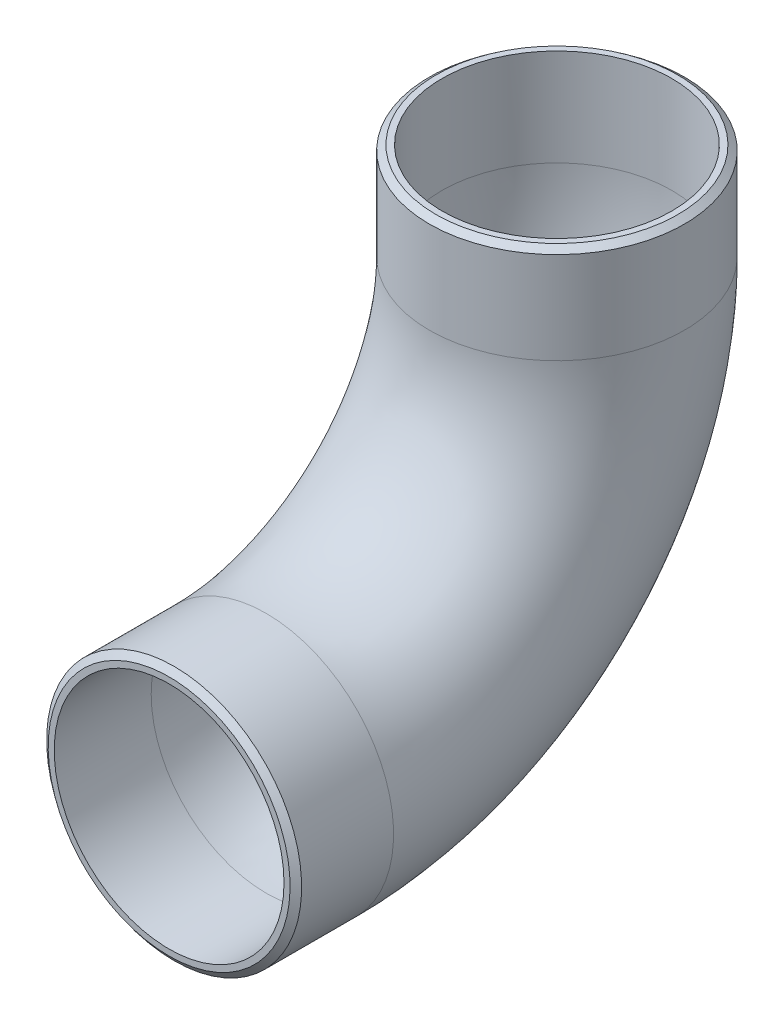
ISO-10303-21;
HEADER;
FILE_DESCRIPTION(('STEP AP214'),'2;1');
FILE_NAME('part.step','',(''),(''),'','','');
FILE_SCHEMA(('AUTOMOTIVE_DESIGN { 1 0 10303 214 1 1 1 1 }'));
ENDSEC;
DATA;
#1=APPLICATION_CONTEXT('core data for automotive mechanical design processes');
#2=APPLICATION_PROTOCOL_DEFINITION('international standard','automotive_design',2000,#1);
#3=PRODUCT_CONTEXT('',#1,'mechanical');
#4=PRODUCT('Part','Part','',(#3));
#5=PRODUCT_RELATED_PRODUCT_CATEGORY('part','',(#4));
#6=PRODUCT_DEFINITION_FORMATION('','',#4);
#7=PRODUCT_DEFINITION_CONTEXT('part definition',#1,'design');
#8=PRODUCT_DEFINITION('design','',#6,#7);
#9=PRODUCT_DEFINITION_SHAPE('','',#8);
#10=(LENGTH_UNIT() NAMED_UNIT(*) SI_UNIT(.MILLI.,.METRE.));
#11=(NAMED_UNIT(*) PLANE_ANGLE_UNIT() SI_UNIT($,.RADIAN.));
#12=(NAMED_UNIT(*) SI_UNIT($,.STERADIAN.) SOLID_ANGLE_UNIT());
#13=UNCERTAINTY_MEASURE_WITH_UNIT(LENGTH_MEASURE(1.E-05),#10,'distance_accuracy_value','');
#14=(GEOMETRIC_REPRESENTATION_CONTEXT(3) GLOBAL_UNCERTAINTY_ASSIGNED_CONTEXT((#13)) GLOBAL_UNIT_ASSIGNED_CONTEXT((#10,
#11,#12)) REPRESENTATION_CONTEXT('',''));
#15=CARTESIAN_POINT('',(0.,0.,0.));
#16=DIRECTION('',(0.,0.,1.));
#17=DIRECTION('',(1.,0.,0.));
#18=AXIS2_PLACEMENT_3D('',#15,#16,#17);
#19=CARTESIAN_POINT('',(0.,17.0337006258828,13.4051291973114));
#20=DIRECTION('',(0.,1.,0.));
#21=DIRECTION('',(0.,0.,1.));
#22=AXIS2_PLACEMENT_3D('',#19,#20,#21);
#23=CYLINDRICAL_SURFACE('',#22,1.59052380952381);
#24=CARTESIAN_POINT('',(0.,18.1805776677452,13.4051291973114));
#25=DIRECTION('',(0.,1.,0.));
#26=DIRECTION('',(0.,0.,1.));
#27=AXIS2_PLACEMENT_3D('',#24,#25,#26);
#28=CIRCLE('',#27,1.59052380952381);
#29=CARTESIAN_POINT('',(0.,18.1805776677452,14.9956530068352));
#30=VERTEX_POINT('',#29);
#31=EDGE_CURVE('E64',#30,#30,#28,.T.);
#32=ORIENTED_EDGE('',*,*,#31,.F.);
#33=EDGE_LOOP('',(#32));
#34=FACE_BOUND('',#33,.T.);
#35=CARTESIAN_POINT('',(0.,17.0337006258828,13.4051291973114));
#36=DIRECTION('',(0.,-1.,0.));
#37=DIRECTION('',(1.,0.,0.));
#38=AXIS2_PLACEMENT_3D('',#35,#36,#37);
#39=CIRCLE('',#38,1.59052380952381);
#40=CARTESIAN_POINT('',(0.,17.0337006258828,11.8146053877876));
#41=VERTEX_POINT('',#40);
#42=EDGE_CURVE('E39',#41,#41,#39,.T.);
#43=ORIENTED_EDGE('',*,*,#42,.F.);
#44=EDGE_LOOP('',(#43));
#45=FACE_BOUND('',#44,.T.);
#46=ADVANCED_FACE('F33',(#34,#45),#23,.T.);
#47=CARTESIAN_POINT('',(0.,17.0337006258828,13.4051291973114));
#48=DIRECTION('',(0.,1.,0.));
#49=DIRECTION('',(0.,0.,1.));
#50=AXIS2_PLACEMENT_3D('',#47,#48,#49);
#51=CYLINDRICAL_SURFACE('',#50,1.43328571428571);
#52=CARTESIAN_POINT('',(0.,17.0337006258828,13.4051291973114));
#53=DIRECTION('',(0.,-1.,0.));
#54=DIRECTION('',(1.,0.,0.));
#55=AXIS2_PLACEMENT_3D('',#52,#53,#54);
#56=CIRCLE('',#55,1.43328571428571);
#57=CARTESIAN_POINT('',(0.,17.0337006258828,11.9718434830256));
#58=VERTEX_POINT('',#57);
#59=EDGE_CURVE('E43',#58,#58,#56,.T.);
#60=ORIENTED_EDGE('',*,*,#59,.T.);
#61=EDGE_LOOP('',(#60));
#62=FACE_BOUND('',#61,.T.);
#63=CARTESIAN_POINT('',(0.,18.2432244354066,13.4051291973114));
#64=DIRECTION('',(0.,-1.,0.));
#65=DIRECTION('',(1.,0.,0.));
#66=AXIS2_PLACEMENT_3D('',#63,#64,#65);
#67=CIRCLE('',#66,1.43328571428571);
#68=CARTESIAN_POINT('',(1.43328571428571,18.2432244354066,13.4051291973114));
#69=VERTEX_POINT('',#68);
#70=EDGE_CURVE('E10',#69,#69,#67,.T.);
#71=ORIENTED_EDGE('',*,*,#70,.F.);
#72=EDGE_LOOP('',(#71));
#73=FACE_BOUND('',#72,.T.);
#74=ADVANCED_FACE('F82',(#62,#73),#51,.F.);
#75=CARTESIAN_POINT('',(0.,17.0337006258828,17.0337006258828));
#76=DIRECTION('',(1.,0.,0.));
#77=DIRECTION('',(0.,0.,-1.));
#78=AXIS2_PLACEMENT_3D('',#75,#76,#77);
#79=TOROIDAL_SURFACE('',#78,3.62857142857143,1.59052380952381);
#80=CARTESIAN_POINT('',(0.,13.4051291973114,17.0337006258828));
#81=DIRECTION('',(0.,0.,1.));
#82=DIRECTION('',(1.,0.,0.));
#83=AXIS2_PLACEMENT_3D('',#80,#81,#82);
#84=CIRCLE('',#83,1.59052380952381);
#85=CARTESIAN_POINT('',(0.,11.8146053877876,17.0337006258828));
#86=VERTEX_POINT('',#85);
#87=EDGE_CURVE('E47',#86,#86,#84,.T.);
#88=CARTESIAN_POINT('',(0.,17.0337006258828,17.0337006258828));
#89=DIRECTION('',(1.,0.,0.));
#90=DIRECTION('',(0.,0.,-1.));
#91=AXIS2_PLACEMENT_3D('',#88,#89,#90);
#92=CIRCLE('',#91,5.21909523809524);
#93=EDGE_CURVE('',#86,#41,#92,.T.);
#94=ORIENTED_EDGE('',*,*,#87,.F.);
#95=ORIENTED_EDGE('',*,*,#42,.T.);
#96=ORIENTED_EDGE('',*,*,#93,.T.);
#97=ORIENTED_EDGE('',*,*,#93,.F.);
#98=EDGE_LOOP('',(#94,#96,#95,#97));
#99=FACE_BOUND('',#98,.T.);
#100=ADVANCED_FACE('F86',(#99),#79,.T.);
#101=CARTESIAN_POINT('',(0.,17.0337006258828,17.0337006258828));
#102=DIRECTION('',(1.,0.,0.));
#103=DIRECTION('',(0.,0.,-1.));
#104=AXIS2_PLACEMENT_3D('',#101,#102,#103);
#105=TOROIDAL_SURFACE('',#104,3.62857142857143,1.43328571428571);
#106=CARTESIAN_POINT('',(0.,13.4051291973114,17.0337006258828));
#107=DIRECTION('',(0.,0.,1.));
#108=DIRECTION('',(1.,0.,0.));
#109=AXIS2_PLACEMENT_3D('',#106,#107,#108);
#110=CIRCLE('',#109,1.43328571428571);
#111=CARTESIAN_POINT('',(0.,11.9718434830257,17.0337006258828));
#112=VERTEX_POINT('',#111);
#113=EDGE_CURVE('E53',#112,#112,#110,.T.);
#114=CARTESIAN_POINT('',(0.,17.0337006258828,17.0337006258828));
#115=DIRECTION('',(1.,0.,0.));
#116=DIRECTION('',(0.,0.,-1.));
#117=AXIS2_PLACEMENT_3D('',#114,#115,#116);
#118=CIRCLE('',#117,5.06185714285714);
#119=EDGE_CURVE('',#112,#58,#118,.T.);
#120=ORIENTED_EDGE('',*,*,#113,.T.);
#121=ORIENTED_EDGE('',*,*,#59,.F.);
#122=ORIENTED_EDGE('',*,*,#119,.T.);
#123=ORIENTED_EDGE('',*,*,#119,.F.);
#124=EDGE_LOOP('',(#120,#122,#121,#123));
#125=FACE_BOUND('',#124,.T.);
#126=ADVANCED_FACE('F91',(#125),#105,.F.);
#127=CARTESIAN_POINT('',(0.,13.4051291973114,17.0337006258828));
#128=DIRECTION('',(0.,0.,1.));
#129=DIRECTION('',(1.,0.,0.));
#130=AXIS2_PLACEMENT_3D('',#127,#128,#129);
#131=CYLINDRICAL_SURFACE('',#130,1.43328571428571);
#132=ORIENTED_EDGE('',*,*,#113,.F.);
#133=EDGE_LOOP('',(#132));
#134=FACE_BOUND('',#133,.T.);
#135=CARTESIAN_POINT('',(0.,13.4051291973114,18.2432244354066));
#136=DIRECTION('',(0.,0.,1.));
#137=DIRECTION('',(1.,0.,0.));
#138=AXIS2_PLACEMENT_3D('',#135,#136,#137);
#139=CIRCLE('',#138,1.43328571428571);
#140=CARTESIAN_POINT('',(1.43328571428571,13.4051291973114,18.2432244354066));
#141=VERTEX_POINT('',#140);
#142=EDGE_CURVE('E50',#141,#141,#139,.T.);
#143=ORIENTED_EDGE('',*,*,#142,.T.);
#144=EDGE_LOOP('',(#143));
#145=FACE_BOUND('',#144,.T.);
#146=ADVANCED_FACE('F98',(#134,#145),#131,.F.);
#147=CARTESIAN_POINT('',(0.,13.4051291973114,17.0337006258828));
#148=DIRECTION('',(0.,0.,1.));
#149=DIRECTION('',(1.,0.,0.));
#150=AXIS2_PLACEMENT_3D('',#147,#148,#149);
#151=CYLINDRICAL_SURFACE('',#150,1.59052380952381);
#152=CARTESIAN_POINT('',(0.,13.4051291973114,18.1805776677452));
#153=DIRECTION('',(0.,0.,1.));
#154=DIRECTION('',(0.,-1.,0.));
#155=AXIS2_PLACEMENT_3D('',#152,#153,#154);
#156=CIRCLE('',#155,1.59052380952381);
#157=CARTESIAN_POINT('',(0.,11.8146053877876,18.1805776677452));
#158=VERTEX_POINT('',#157);
#159=EDGE_CURVE('E54',#158,#158,#156,.T.);
#160=ORIENTED_EDGE('',*,*,#159,.F.);
#161=EDGE_LOOP('',(#160));
#162=FACE_BOUND('',#161,.T.);
#163=ORIENTED_EDGE('',*,*,#87,.T.);
#164=EDGE_LOOP('',(#163));
#165=FACE_BOUND('',#164,.T.);
#166=ADVANCED_FACE('F102',(#162,#165),#151,.T.);
#167=CARTESIAN_POINT('',(0.,18.2432244354066,13.4051291973114));
#168=DIRECTION('',(0.,-1.,0.));
#169=DIRECTION('',(1.,0.,0.));
#170=AXIS2_PLACEMENT_3D('',#167,#168,#169);
#171=PLANE('',#170);
#172=CARTESIAN_POINT('',(0.,18.2432244354066,13.4051291973114));
#173=DIRECTION('',(0.,1.,0.));
#174=DIRECTION('',(0.,0.,1.));
#175=AXIS2_PLACEMENT_3D('',#172,#173,#174);
#176=CIRCLE('',#175,1.50888095238095);
#177=CARTESIAN_POINT('',(0.,18.2432244354066,14.9140101496923));
#178=VERTEX_POINT('',#177);
#179=EDGE_CURVE('E67',#178,#178,#176,.T.);
#180=ORIENTED_EDGE('',*,*,#179,.T.);
#181=EDGE_LOOP('',(#180));
#182=FACE_BOUND('',#181,.T.);
#183=ORIENTED_EDGE('',*,*,#70,.T.);
#184=EDGE_LOOP('',(#183));
#185=FACE_BOUND('',#184,.T.);
#186=ADVANCED_FACE('F71',(#182,#185),#171,.F.);
#187=CARTESIAN_POINT('',(0.,13.4051291973114,18.2432244354066));
#188=DIRECTION('',(0.,0.,1.));
#189=DIRECTION('',(1.,0.,0.));
#190=AXIS2_PLACEMENT_3D('',#187,#188,#189);
#191=PLANE('',#190);
#192=CARTESIAN_POINT('',(0.,13.4051291973114,18.2432244354066));
#193=DIRECTION('',(0.,0.,1.));
#194=DIRECTION('',(0.,-1.,0.));
#195=AXIS2_PLACEMENT_3D('',#192,#193,#194);
#196=CIRCLE('',#195,1.50888095238095);
#197=CARTESIAN_POINT('',(0.,11.8962482449304,18.2432244354066));
#198=VERTEX_POINT('',#197);
#199=EDGE_CURVE('E61',#198,#198,#196,.T.);
#200=ORIENTED_EDGE('',*,*,#199,.T.);
#201=EDGE_LOOP('',(#200));
#202=FACE_BOUND('',#201,.T.);
#203=ORIENTED_EDGE('',*,*,#142,.F.);
#204=EDGE_LOOP('',(#203));
#205=FACE_BOUND('',#204,.T.);
#206=ADVANCED_FACE('F107',(#202,#205),#191,.T.);
#207=CARTESIAN_POINT('',(0.,13.4051291973114,18.1805776677452));
#208=DIRECTION('',(0.,0.,-1.));
#209=DIRECTION('',(0.,1.,0.));
#210=AXIS2_PLACEMENT_3D('',#207,#208,#209);
#211=CONICAL_SURFACE('',#210,1.59052380952381,0.916297857297032);
#212=ORIENTED_EDGE('',*,*,#199,.F.);
#213=EDGE_LOOP('',(#212));
#214=FACE_BOUND('',#213,.T.);
#215=ORIENTED_EDGE('',*,*,#159,.T.);
#216=EDGE_LOOP('',(#215));
#217=FACE_BOUND('',#216,.T.);
#218=ADVANCED_FACE('F76',(#214,#217),#211,.T.);
#219=CARTESIAN_POINT('',(0.,18.1805776677452,13.4051291973114));
#220=DIRECTION('',(0.,-1.,0.));
#221=DIRECTION('',(0.,0.,-1.));
#222=AXIS2_PLACEMENT_3D('',#219,#220,#221);
#223=CONICAL_SURFACE('',#222,1.59052380952381,0.916297857297042);
#224=ORIENTED_EDGE('',*,*,#179,.F.);
#225=EDGE_LOOP('',(#224));
#226=FACE_BOUND('',#225,.T.);
#227=ORIENTED_EDGE('',*,*,#31,.T.);
#228=EDGE_LOOP('',(#227));
#229=FACE_BOUND('',#228,.T.);
#230=ADVANCED_FACE('F73',(#226,#229),#223,.T.);
#231=CLOSED_SHELL('',(#46,#74,#100,#126,#146,#166,#186,#206,#218,#230));
#232=MANIFOLD_SOLID_BREP('B2',#231);
#233=ADVANCED_BREP_SHAPE_REPRESENTATION('',(#18,#232),#14);
#234=SHAPE_DEFINITION_REPRESENTATION(#9,#233);
ENDSEC;
END-ISO-10303-21;
